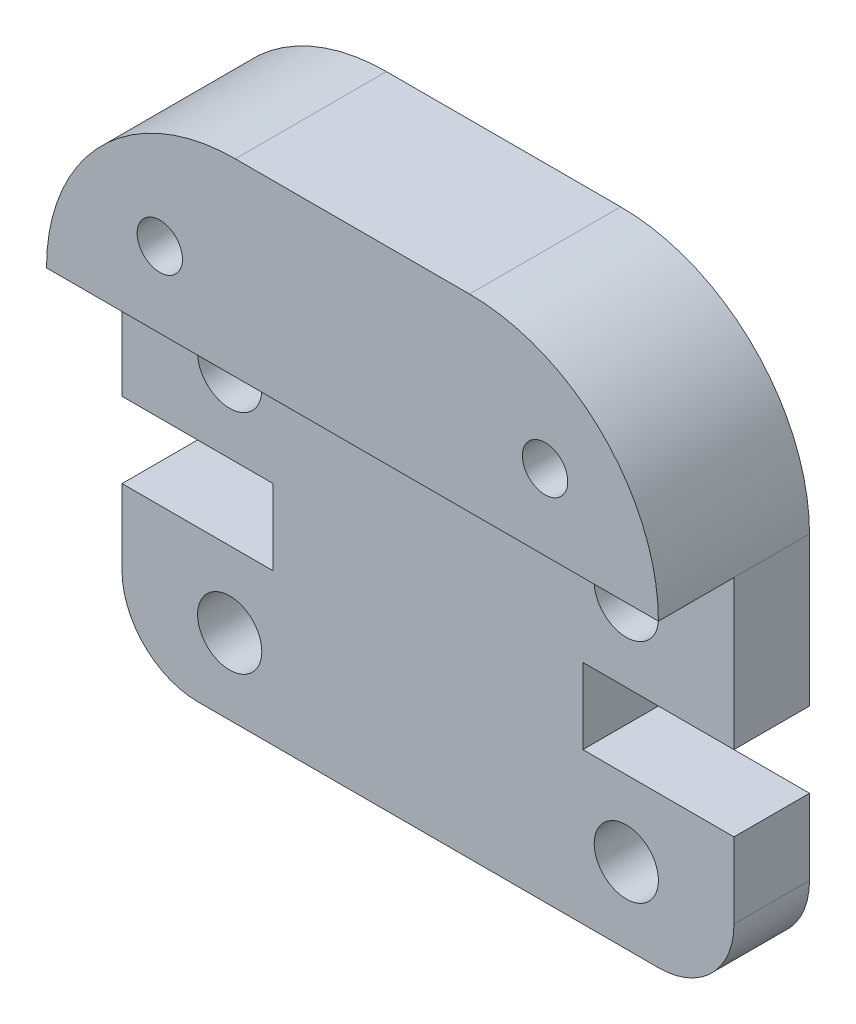
ISO-10303-21;
HEADER;
FILE_DESCRIPTION(('STEP AP214'),'2;1');
FILE_NAME('part.step','',(''),(''),'','','');
FILE_SCHEMA(('AUTOMOTIVE_DESIGN { 1 0 10303 214 1 1 1 1 }'));
ENDSEC;
DATA;
#1=APPLICATION_CONTEXT('core data for automotive mechanical design processes');
#2=APPLICATION_PROTOCOL_DEFINITION('international standard','automotive_design',2000,#1);
#3=PRODUCT_CONTEXT('',#1,'mechanical');
#4=PRODUCT('Part','Part','',(#3));
#5=PRODUCT_RELATED_PRODUCT_CATEGORY('part','',(#4));
#6=PRODUCT_DEFINITION_FORMATION('','',#4);
#7=PRODUCT_DEFINITION_CONTEXT('part definition',#1,'design');
#8=PRODUCT_DEFINITION('design','',#6,#7);
#9=PRODUCT_DEFINITION_SHAPE('','',#8);
#10=(LENGTH_UNIT() NAMED_UNIT(*) SI_UNIT(.MILLI.,.METRE.));
#11=(NAMED_UNIT(*) PLANE_ANGLE_UNIT() SI_UNIT($,.RADIAN.));
#12=(NAMED_UNIT(*) SI_UNIT($,.STERADIAN.) SOLID_ANGLE_UNIT());
#13=UNCERTAINTY_MEASURE_WITH_UNIT(LENGTH_MEASURE(1.E-05),#10,'distance_accuracy_value','');
#14=(GEOMETRIC_REPRESENTATION_CONTEXT(3) GLOBAL_UNCERTAINTY_ASSIGNED_CONTEXT((#13)) GLOBAL_UNIT_ASSIGNED_CONTEXT((#10,
#11,#12)) REPRESENTATION_CONTEXT('',''));
#15=CARTESIAN_POINT('',(0.,0.,0.));
#16=DIRECTION('',(0.,0.,1.));
#17=DIRECTION('',(1.,0.,0.));
#18=AXIS2_PLACEMENT_3D('',#15,#16,#17);
#19=CARTESIAN_POINT('',(14.2,2.,4.));
#20=DIRECTION('',(0.,0.,-1.));
#21=DIRECTION('',(-1.,0.,0.));
#22=AXIS2_PLACEMENT_3D('',#19,#20,#21);
#23=PLANE('',#22);
#24=CARTESIAN_POINT('',(3.00000000000321,11.942,4.));
#25=DIRECTION('',(0.,0.,1.));
#26=DIRECTION('',(1.,0.,0.));
#27=AXIS2_PLACEMENT_3D('',#24,#25,#26);
#28=CIRCLE('',#27,0.6);
#29=CARTESIAN_POINT('',(3.60000000000321,11.942,4.));
#30=VERTEX_POINT('',#29);
#31=EDGE_CURVE('E328',#30,#30,#28,.T.);
#32=ORIENTED_EDGE('',*,*,#31,.F.);
#33=EDGE_LOOP('',(#32));
#34=FACE_BOUND('',#33,.T.);
#35=CARTESIAN_POINT('',(13.1999999999968,11.942,4.));
#36=DIRECTION('',(0.,0.,1.));
#37=DIRECTION('',(-1.,0.,0.));
#38=AXIS2_PLACEMENT_3D('',#35,#36,#37);
#39=CIRCLE('',#38,0.6);
#40=CARTESIAN_POINT('',(12.5999999999968,11.942,4.));
#41=VERTEX_POINT('',#40);
#42=EDGE_CURVE('E334',#41,#41,#39,.T.);
#43=ORIENTED_EDGE('',*,*,#42,.F.);
#44=EDGE_LOOP('',(#43));
#45=FACE_BOUND('',#44,.T.);
#46=DIRECTION('',(1.,0.,0.));
#47=VECTOR('',#46,1.);
#48=CARTESIAN_POINT('',(16.2,9.945,4.));
#49=LINE('',#48,#47);
#50=CARTESIAN_POINT('',(0.,9.94499999999999,4.));
#51=VERTEX_POINT('',#50);
#52=CARTESIAN_POINT('',(16.2,9.945,4.));
#53=VERTEX_POINT('',#52);
#54=EDGE_CURVE('E280',#51,#53,#49,.T.);
#55=ORIENTED_EDGE('',*,*,#54,.T.);
#56=CARTESIAN_POINT('',(11.2,9.94499999999999,4.));
#57=DIRECTION('',(0.,0.,1.));
#58=DIRECTION('',(-1.,0.,0.));
#59=AXIS2_PLACEMENT_3D('',#56,#57,#58);
#60=CIRCLE('',#59,5.);
#61=CARTESIAN_POINT('',(11.2,14.945,4.));
#62=VERTEX_POINT('',#61);
#63=EDGE_CURVE('E134',#53,#62,#60,.T.);
#64=ORIENTED_EDGE('',*,*,#63,.T.);
#65=DIRECTION('',(-1.,0.,0.));
#66=VECTOR('',#65,1.);
#67=CARTESIAN_POINT('',(5.,14.945,4.));
#68=LINE('',#67,#66);
#69=CARTESIAN_POINT('',(5.,14.945,4.));
#70=VERTEX_POINT('',#69);
#71=EDGE_CURVE('E60',#62,#70,#68,.T.);
#72=ORIENTED_EDGE('',*,*,#71,.T.);
#73=CARTESIAN_POINT('',(5.,9.94499999999999,4.));
#74=DIRECTION('',(0.,0.,1.));
#75=DIRECTION('',(1.,0.,0.));
#76=AXIS2_PLACEMENT_3D('',#73,#74,#75);
#77=CIRCLE('',#76,5.);
#78=EDGE_CURVE('E125',#70,#51,#77,.T.);
#79=ORIENTED_EDGE('',*,*,#78,.T.);
#80=EDGE_LOOP('',(#55,#64,#72,#79));
#81=FACE_BOUND('',#80,.T.);
#82=ADVANCED_FACE('F35',(#34,#45,#81),#23,.F.);
#83=CARTESIAN_POINT('',(14.2,2.,4.));
#84=DIRECTION('',(0.,0.,-1.));
#85=DIRECTION('',(-1.,0.,0.));
#86=AXIS2_PLACEMENT_3D('',#83,#84,#85);
#87=CYLINDRICAL_SURFACE('',#86,2.);
#88=CARTESIAN_POINT('',(14.2,2.,2.));
#89=DIRECTION('',(0.,0.,1.));
#90=DIRECTION('',(1.,0.,0.));
#91=AXIS2_PLACEMENT_3D('',#88,#89,#90);
#92=CIRCLE('',#91,2.);
#93=CARTESIAN_POINT('',(14.2,0.,2.));
#94=VERTEX_POINT('',#93);
#95=CARTESIAN_POINT('',(16.2,2.,2.));
#96=VERTEX_POINT('',#95);
#97=EDGE_CURVE('E122',#94,#96,#92,.T.);
#98=ORIENTED_EDGE('',*,*,#97,.F.);
#99=DIRECTION('',(0.,0.,-1.));
#100=VECTOR('',#99,1.);
#101=CARTESIAN_POINT('',(14.2,0.,4.));
#102=LINE('',#101,#100);
#103=CARTESIAN_POINT('',(14.2,0.,0.));
#104=VERTEX_POINT('',#103);
#105=EDGE_CURVE('E115',#94,#104,#102,.T.);
#106=ORIENTED_EDGE('',*,*,#105,.T.);
#107=CARTESIAN_POINT('',(14.2,2.,0.));
#108=DIRECTION('',(0.,0.,1.));
#109=DIRECTION('',(-1.,0.,0.));
#110=AXIS2_PLACEMENT_3D('',#107,#108,#109);
#111=CIRCLE('',#110,2.);
#112=CARTESIAN_POINT('',(16.2,2.,0.));
#113=VERTEX_POINT('',#112);
#114=EDGE_CURVE('E119',#104,#113,#111,.T.);
#115=ORIENTED_EDGE('',*,*,#114,.T.);
#116=DIRECTION('',(0.,0.,-1.));
#117=VECTOR('',#116,1.);
#118=CARTESIAN_POINT('',(16.2,2.,4.));
#119=LINE('',#118,#117);
#120=EDGE_CURVE('E11',#96,#113,#119,.T.);
#121=ORIENTED_EDGE('',*,*,#120,.F.);
#122=EDGE_LOOP('',(#98,#106,#115,#121));
#123=FACE_BOUND('',#122,.T.);
#124=ADVANCED_FACE('F37',(#123),#87,.T.);
#125=CARTESIAN_POINT('',(16.2,2.,4.));
#126=DIRECTION('',(-1.,0.,0.));
#127=DIRECTION('',(0.,0.,1.));
#128=AXIS2_PLACEMENT_3D('',#125,#126,#127);
#129=PLANE('',#128);
#130=DIRECTION('',(0.,-1.,0.));
#131=VECTOR('',#130,1.);
#132=CARTESIAN_POINT('',(16.2,0.,2.));
#133=LINE('',#132,#131);
#134=CARTESIAN_POINT('',(16.2,4.,2.));
#135=VERTEX_POINT('',#134);
#136=EDGE_CURVE('E343',#135,#96,#133,.T.);
#137=ORIENTED_EDGE('',*,*,#136,.T.);
#138=ORIENTED_EDGE('',*,*,#120,.T.);
#139=DIRECTION('',(0.,1.,0.));
#140=VECTOR('',#139,1.);
#141=CARTESIAN_POINT('',(16.2,2.,0.));
#142=LINE('',#141,#140);
#143=CARTESIAN_POINT('',(16.2,4.,0.));
#144=VERTEX_POINT('',#143);
#145=EDGE_CURVE('E142',#113,#144,#142,.T.);
#146=ORIENTED_EDGE('',*,*,#145,.T.);
#147=DIRECTION('',(0.,0.,-1.));
#148=VECTOR('',#147,1.);
#149=CARTESIAN_POINT('',(16.2,4.,4.));
#150=LINE('',#149,#148);
#151=EDGE_CURVE('E44',#135,#144,#150,.T.);
#152=ORIENTED_EDGE('',*,*,#151,.F.);
#153=EDGE_LOOP('',(#137,#138,#146,#152));
#154=FACE_BOUND('',#153,.T.);
#155=ADVANCED_FACE('F229',(#154),#129,.F.);
#156=CARTESIAN_POINT('',(12.2,4.,4.));
#157=DIRECTION('',(0.,-1.,0.));
#158=DIRECTION('',(1.,0.,0.));
#159=AXIS2_PLACEMENT_3D('',#156,#157,#158);
#160=PLANE('',#159);
#161=DIRECTION('',(-1.,0.,0.));
#162=VECTOR('',#161,1.);
#163=CARTESIAN_POINT('',(12.2,4.,2.));
#164=LINE('',#163,#162);
#165=CARTESIAN_POINT('',(12.2,4.,2.));
#166=VERTEX_POINT('',#165);
#167=EDGE_CURVE('E226',#135,#166,#164,.T.);
#168=ORIENTED_EDGE('',*,*,#167,.F.);
#169=ORIENTED_EDGE('',*,*,#151,.T.);
#170=DIRECTION('',(-1.,0.,0.));
#171=VECTOR('',#170,1.);
#172=CARTESIAN_POINT('',(12.2,4.,0.));
#173=LINE('',#172,#171);
#174=CARTESIAN_POINT('',(12.2,4.,0.));
#175=VERTEX_POINT('',#174);
#176=EDGE_CURVE('E145',#144,#175,#173,.T.);
#177=ORIENTED_EDGE('',*,*,#176,.T.);
#178=DIRECTION('',(0.,0.,-1.));
#179=VECTOR('',#178,1.);
#180=CARTESIAN_POINT('',(12.2,4.,4.));
#181=LINE('',#180,#179);
#182=EDGE_CURVE('E216',#166,#175,#181,.T.);
#183=ORIENTED_EDGE('',*,*,#182,.F.);
#184=EDGE_LOOP('',(#168,#169,#177,#183));
#185=FACE_BOUND('',#184,.T.);
#186=ADVANCED_FACE('F221',(#185),#160,.F.);
#187=CARTESIAN_POINT('',(12.2,6.,4.));
#188=DIRECTION('',(-1.,0.,0.));
#189=DIRECTION('',(0.,0.,1.));
#190=AXIS2_PLACEMENT_3D('',#187,#188,#189);
#191=PLANE('',#190);
#192=DIRECTION('',(0.,1.,0.));
#193=VECTOR('',#192,1.);
#194=CARTESIAN_POINT('',(12.2,6.,2.));
#195=LINE('',#194,#193);
#196=CARTESIAN_POINT('',(12.2,6.,2.));
#197=VERTEX_POINT('',#196);
#198=EDGE_CURVE('E238',#166,#197,#195,.T.);
#199=ORIENTED_EDGE('',*,*,#198,.F.);
#200=ORIENTED_EDGE('',*,*,#182,.T.);
#201=DIRECTION('',(0.,1.,0.));
#202=VECTOR('',#201,1.);
#203=CARTESIAN_POINT('',(12.2,6.,0.));
#204=LINE('',#203,#202);
#205=CARTESIAN_POINT('',(12.2,6.,0.));
#206=VERTEX_POINT('',#205);
#207=EDGE_CURVE('E155',#175,#206,#204,.T.);
#208=ORIENTED_EDGE('',*,*,#207,.T.);
#209=DIRECTION('',(0.,0.,-1.));
#210=VECTOR('',#209,1.);
#211=CARTESIAN_POINT('',(12.2,6.,4.));
#212=LINE('',#211,#210);
#213=EDGE_CURVE('E214',#197,#206,#212,.T.);
#214=ORIENTED_EDGE('',*,*,#213,.F.);
#215=EDGE_LOOP('',(#199,#200,#208,#214));
#216=FACE_BOUND('',#215,.T.);
#217=ADVANCED_FACE('F235',(#216),#191,.F.);
#218=CARTESIAN_POINT('',(16.2,6.00000000000001,4.));
#219=DIRECTION('',(0.,1.,0.));
#220=DIRECTION('',(-1.,0.,0.));
#221=AXIS2_PLACEMENT_3D('',#218,#219,#220);
#222=PLANE('',#221);
#223=DIRECTION('',(1.,0.,0.));
#224=VECTOR('',#223,1.);
#225=CARTESIAN_POINT('',(16.2,6.00000000000001,2.));
#226=LINE('',#225,#224);
#227=CARTESIAN_POINT('',(16.2,6.00000000000001,2.));
#228=VERTEX_POINT('',#227);
#229=EDGE_CURVE('E310',#197,#228,#226,.T.);
#230=ORIENTED_EDGE('',*,*,#229,.F.);
#231=ORIENTED_EDGE('',*,*,#213,.T.);
#232=DIRECTION('',(1.,0.,0.));
#233=VECTOR('',#232,1.);
#234=CARTESIAN_POINT('',(16.2,6.00000000000001,0.));
#235=LINE('',#234,#233);
#236=CARTESIAN_POINT('',(16.2,6.00000000000001,0.));
#237=VERTEX_POINT('',#236);
#238=EDGE_CURVE('E158',#206,#237,#235,.T.);
#239=ORIENTED_EDGE('',*,*,#238,.T.);
#240=DIRECTION('',(0.,0.,-1.));
#241=VECTOR('',#240,1.);
#242=CARTESIAN_POINT('',(16.2,6.00000000000001,4.));
#243=LINE('',#242,#241);
#244=EDGE_CURVE('E212',#228,#237,#243,.T.);
#245=ORIENTED_EDGE('',*,*,#244,.F.);
#246=EDGE_LOOP('',(#230,#231,#239,#245));
#247=FACE_BOUND('',#246,.T.);
#248=ADVANCED_FACE('F355',(#247),#222,.F.);
#249=CARTESIAN_POINT('',(16.2,9.945,4.));
#250=DIRECTION('',(-1.,0.,0.));
#251=DIRECTION('',(0.,-1.,0.));
#252=AXIS2_PLACEMENT_3D('',#249,#250,#251);
#253=PLANE('',#252);
#254=CARTESIAN_POINT('',(16.2,9.945,2.));
#255=VERTEX_POINT('',#254);
#256=EDGE_CURVE('E289',#255,#228,#133,.T.);
#257=ORIENTED_EDGE('',*,*,#256,.T.);
#258=ORIENTED_EDGE('',*,*,#244,.T.);
#259=DIRECTION('',(0.,1.,0.));
#260=VECTOR('',#259,1.);
#261=CARTESIAN_POINT('',(16.2,9.945,0.));
#262=LINE('',#261,#260);
#263=CARTESIAN_POINT('',(16.2,9.945,0.));
#264=VERTEX_POINT('',#263);
#265=EDGE_CURVE('E161',#237,#264,#262,.T.);
#266=ORIENTED_EDGE('',*,*,#265,.T.);
#267=DIRECTION('',(0.,0.,-1.));
#268=VECTOR('',#267,1.);
#269=CARTESIAN_POINT('',(16.2,9.945,4.));
#270=LINE('',#269,#268);
#271=EDGE_CURVE('E208',#255,#264,#270,.T.);
#272=ORIENTED_EDGE('',*,*,#271,.F.);
#273=EDGE_LOOP('',(#257,#258,#266,#272));
#274=FACE_BOUND('',#273,.T.);
#275=ADVANCED_FACE('F351',(#274),#253,.F.);
#276=CARTESIAN_POINT('',(0.,9.94499999999999,4.));
#277=DIRECTION('',(1.,0.,0.));
#278=DIRECTION('',(0.,0.,-1.));
#279=AXIS2_PLACEMENT_3D('',#276,#277,#278);
#280=PLANE('',#279);
#281=DIRECTION('',(0.,1.,0.));
#282=VECTOR('',#281,1.);
#283=CARTESIAN_POINT('',(0.,9.94499999999999,2.));
#284=LINE('',#283,#282);
#285=CARTESIAN_POINT('',(0.,6.00000000000001,2.));
#286=VERTEX_POINT('',#285);
#287=CARTESIAN_POINT('',(0.,9.94499999999999,2.));
#288=VERTEX_POINT('',#287);
#289=EDGE_CURVE('E286',#286,#288,#284,.T.);
#290=ORIENTED_EDGE('',*,*,#289,.T.);
#291=DIRECTION('',(0.,0.,-1.));
#292=VECTOR('',#291,1.);
#293=CARTESIAN_POINT('',(0.,9.94499999999999,4.));
#294=LINE('',#293,#292);
#295=CARTESIAN_POINT('',(0.,9.94499999999999,0.));
#296=VERTEX_POINT('',#295);
#297=EDGE_CURVE('E198',#288,#296,#294,.T.);
#298=ORIENTED_EDGE('',*,*,#297,.T.);
#299=DIRECTION('',(0.,-1.,0.));
#300=VECTOR('',#299,1.);
#301=CARTESIAN_POINT('',(0.,9.94499999999999,0.));
#302=LINE('',#301,#300);
#303=CARTESIAN_POINT('',(0.,6.00000000000001,0.));
#304=VERTEX_POINT('',#303);
#305=EDGE_CURVE('E171',#296,#304,#302,.T.);
#306=ORIENTED_EDGE('',*,*,#305,.T.);
#307=DIRECTION('',(0.,0.,-1.));
#308=VECTOR('',#307,1.);
#309=CARTESIAN_POINT('',(0.,6.00000000000001,4.));
#310=LINE('',#309,#308);
#311=EDGE_CURVE('E196',#286,#304,#310,.T.);
#312=ORIENTED_EDGE('',*,*,#311,.F.);
#313=EDGE_LOOP('',(#290,#298,#306,#312));
#314=FACE_BOUND('',#313,.T.);
#315=ADVANCED_FACE('F295',(#314),#280,.F.);
#316=CARTESIAN_POINT('',(0.,6.00000000000001,4.));
#317=DIRECTION('',(0.,1.,0.));
#318=DIRECTION('',(0.,0.,1.));
#319=AXIS2_PLACEMENT_3D('',#316,#317,#318);
#320=PLANE('',#319);
#321=DIRECTION('',(1.,0.,0.));
#322=VECTOR('',#321,1.);
#323=CARTESIAN_POINT('',(0.,6.00000000000001,2.));
#324=LINE('',#323,#322);
#325=CARTESIAN_POINT('',(4.,6.00000000000001,2.));
#326=VERTEX_POINT('',#325);
#327=EDGE_CURVE('E308',#286,#326,#324,.T.);
#328=ORIENTED_EDGE('',*,*,#327,.F.);
#329=ORIENTED_EDGE('',*,*,#311,.T.);
#330=DIRECTION('',(1.,0.,0.));
#331=VECTOR('',#330,1.);
#332=CARTESIAN_POINT('',(0.,6.00000000000001,0.));
#333=LINE('',#332,#331);
#334=CARTESIAN_POINT('',(4.,6.00000000000001,0.));
#335=VERTEX_POINT('',#334);
#336=EDGE_CURVE('E174',#304,#335,#333,.T.);
#337=ORIENTED_EDGE('',*,*,#336,.T.);
#338=DIRECTION('',(0.,0.,-1.));
#339=VECTOR('',#338,1.);
#340=CARTESIAN_POINT('',(4.,6.00000000000001,4.));
#341=LINE('',#340,#339);
#342=EDGE_CURVE('E194',#326,#335,#341,.T.);
#343=ORIENTED_EDGE('',*,*,#342,.F.);
#344=EDGE_LOOP('',(#328,#329,#337,#343));
#345=FACE_BOUND('',#344,.T.);
#346=ADVANCED_FACE('F307',(#345),#320,.F.);
#347=CARTESIAN_POINT('',(4.,6.00000000000001,4.));
#348=DIRECTION('',(1.,0.,0.));
#349=DIRECTION('',(0.,0.,-1.));
#350=AXIS2_PLACEMENT_3D('',#347,#348,#349);
#351=PLANE('',#350);
#352=DIRECTION('',(0.,-1.,0.));
#353=VECTOR('',#352,1.);
#354=CARTESIAN_POINT('',(4.,6.00000000000001,2.));
#355=LINE('',#354,#353);
#356=CARTESIAN_POINT('',(4.,4.,2.));
#357=VERTEX_POINT('',#356);
#358=EDGE_CURVE('E311',#326,#357,#355,.T.);
#359=ORIENTED_EDGE('',*,*,#358,.F.);
#360=ORIENTED_EDGE('',*,*,#342,.T.);
#361=DIRECTION('',(0.,-1.,0.));
#362=VECTOR('',#361,1.);
#363=CARTESIAN_POINT('',(4.,6.00000000000001,0.));
#364=LINE('',#363,#362);
#365=CARTESIAN_POINT('',(4.,4.,0.));
#366=VERTEX_POINT('',#365);
#367=EDGE_CURVE('E177',#335,#366,#364,.T.);
#368=ORIENTED_EDGE('',*,*,#367,.T.);
#369=DIRECTION('',(0.,0.,-1.));
#370=VECTOR('',#369,1.);
#371=CARTESIAN_POINT('',(4.,4.,4.));
#372=LINE('',#371,#370);
#373=EDGE_CURVE('E192',#357,#366,#372,.T.);
#374=ORIENTED_EDGE('',*,*,#373,.F.);
#375=EDGE_LOOP('',(#359,#360,#368,#374));
#376=FACE_BOUND('',#375,.T.);
#377=ADVANCED_FACE('F393',(#376),#351,.F.);
#378=CARTESIAN_POINT('',(4.,4.,4.));
#379=DIRECTION('',(0.,-1.,0.));
#380=DIRECTION('',(0.,0.,-1.));
#381=AXIS2_PLACEMENT_3D('',#378,#379,#380);
#382=PLANE('',#381);
#383=DIRECTION('',(-1.,0.,0.));
#384=VECTOR('',#383,1.);
#385=CARTESIAN_POINT('',(4.,4.,2.));
#386=LINE('',#385,#384);
#387=CARTESIAN_POINT('',(0.,4.,2.));
#388=VERTEX_POINT('',#387);
#389=EDGE_CURVE('E314',#357,#388,#386,.T.);
#390=ORIENTED_EDGE('',*,*,#389,.F.);
#391=ORIENTED_EDGE('',*,*,#373,.T.);
#392=DIRECTION('',(-1.,0.,0.));
#393=VECTOR('',#392,1.);
#394=CARTESIAN_POINT('',(4.,4.,0.));
#395=LINE('',#394,#393);
#396=CARTESIAN_POINT('',(0.,4.,0.));
#397=VERTEX_POINT('',#396);
#398=EDGE_CURVE('E180',#366,#397,#395,.T.);
#399=ORIENTED_EDGE('',*,*,#398,.T.);
#400=DIRECTION('',(0.,0.,-1.));
#401=VECTOR('',#400,1.);
#402=CARTESIAN_POINT('',(0.,4.,4.));
#403=LINE('',#402,#401);
#404=EDGE_CURVE('E190',#388,#397,#403,.T.);
#405=ORIENTED_EDGE('',*,*,#404,.F.);
#406=EDGE_LOOP('',(#390,#391,#399,#405));
#407=FACE_BOUND('',#406,.T.);
#408=ADVANCED_FACE('F389',(#407),#382,.F.);
#409=CARTESIAN_POINT('',(0.,2.,4.));
#410=DIRECTION('',(1.,0.,0.));
#411=DIRECTION('',(0.,0.,-1.));
#412=AXIS2_PLACEMENT_3D('',#409,#410,#411);
#413=PLANE('',#412);
#414=CARTESIAN_POINT('',(0.,2.,2.));
#415=VERTEX_POINT('',#414);
#416=EDGE_CURVE('E291',#415,#388,#284,.T.);
#417=ORIENTED_EDGE('',*,*,#416,.T.);
#418=ORIENTED_EDGE('',*,*,#404,.T.);
#419=DIRECTION('',(0.,-1.,0.));
#420=VECTOR('',#419,1.);
#421=CARTESIAN_POINT('',(0.,2.,0.));
#422=LINE('',#421,#420);
#423=CARTESIAN_POINT('',(0.,2.,0.));
#424=VERTEX_POINT('',#423);
#425=EDGE_CURVE('E183',#397,#424,#422,.T.);
#426=ORIENTED_EDGE('',*,*,#425,.T.);
#427=DIRECTION('',(0.,0.,-1.));
#428=VECTOR('',#427,1.);
#429=CARTESIAN_POINT('',(0.,2.,4.));
#430=LINE('',#429,#428);
#431=EDGE_CURVE('E188',#415,#424,#430,.T.);
#432=ORIENTED_EDGE('',*,*,#431,.F.);
#433=EDGE_LOOP('',(#417,#418,#426,#432));
#434=FACE_BOUND('',#433,.T.);
#435=ADVANCED_FACE('F385',(#434),#413,.F.);
#436=CARTESIAN_POINT('',(2.,2.,4.));
#437=DIRECTION('',(0.,0.,-1.));
#438=DIRECTION('',(-1.,0.,0.));
#439=AXIS2_PLACEMENT_3D('',#436,#437,#438);
#440=CYLINDRICAL_SURFACE('',#439,2.);
#441=CARTESIAN_POINT('',(2.,2.,2.));
#442=DIRECTION('',(0.,0.,1.));
#443=DIRECTION('',(1.,0.,0.));
#444=AXIS2_PLACEMENT_3D('',#441,#442,#443);
#445=CIRCLE('',#444,2.);
#446=CARTESIAN_POINT('',(2.,0.,2.));
#447=VERTEX_POINT('',#446);
#448=EDGE_CURVE('E51',#415,#447,#445,.T.);
#449=ORIENTED_EDGE('',*,*,#448,.F.);
#450=ORIENTED_EDGE('',*,*,#431,.T.);
#451=CARTESIAN_POINT('',(2.,2.,0.));
#452=DIRECTION('',(0.,0.,1.));
#453=DIRECTION('',(1.,0.,0.));
#454=AXIS2_PLACEMENT_3D('',#451,#452,#453);
#455=CIRCLE('',#454,2.);
#456=CARTESIAN_POINT('',(2.,0.,0.));
#457=VERTEX_POINT('',#456);
#458=EDGE_CURVE('E135',#424,#457,#455,.T.);
#459=ORIENTED_EDGE('',*,*,#458,.T.);
#460=DIRECTION('',(0.,0.,-1.));
#461=VECTOR('',#460,1.);
#462=CARTESIAN_POINT('',(2.,0.,4.));
#463=LINE('',#462,#461);
#464=EDGE_CURVE('E124',#447,#457,#463,.T.);
#465=ORIENTED_EDGE('',*,*,#464,.F.);
#466=EDGE_LOOP('',(#449,#450,#459,#465));
#467=FACE_BOUND('',#466,.T.);
#468=ADVANCED_FACE('F382',(#467),#440,.T.);
#469=CARTESIAN_POINT('',(2.,0.,4.));
#470=DIRECTION('',(0.,1.,0.));
#471=DIRECTION('',(-1.,0.,0.));
#472=AXIS2_PLACEMENT_3D('',#469,#470,#471);
#473=PLANE('',#472);
#474=DIRECTION('',(-1.,0.,0.));
#475=VECTOR('',#474,1.);
#476=CARTESIAN_POINT('',(0.,0.,2.));
#477=LINE('',#476,#475);
#478=EDGE_CURVE('E296',#94,#447,#477,.T.);
#479=ORIENTED_EDGE('',*,*,#478,.T.);
#480=ORIENTED_EDGE('',*,*,#464,.T.);
#481=DIRECTION('',(1.,0.,0.));
#482=VECTOR('',#481,1.);
#483=CARTESIAN_POINT('',(2.,0.,0.));
#484=LINE('',#483,#482);
#485=EDGE_CURVE('E128',#457,#104,#484,.T.);
#486=ORIENTED_EDGE('',*,*,#485,.T.);
#487=ORIENTED_EDGE('',*,*,#105,.F.);
#488=EDGE_LOOP('',(#479,#480,#486,#487));
#489=FACE_BOUND('',#488,.T.);
#490=ADVANCED_FACE('F129',(#489),#473,.F.);
#491=CARTESIAN_POINT('',(13.35,8.,4.));
#492=DIRECTION('',(0.,0.,-1.));
#493=DIRECTION('',(-1.,0.,0.));
#494=AXIS2_PLACEMENT_3D('',#491,#492,#493);
#495=CYLINDRICAL_SURFACE('',#494,0.85);
#496=CARTESIAN_POINT('',(13.35,8.,0.));
#497=DIRECTION('',(0.,0.,1.));
#498=DIRECTION('',(1.,0.,0.));
#499=AXIS2_PLACEMENT_3D('',#496,#497,#498);
#500=CIRCLE('',#499,0.85);
#501=CARTESIAN_POINT('',(14.2,8.,0.));
#502=VERTEX_POINT('',#501);
#503=EDGE_CURVE('E143',#502,#502,#500,.T.);
#504=ORIENTED_EDGE('',*,*,#503,.F.);
#505=EDGE_LOOP('',(#504));
#506=FACE_BOUND('',#505,.T.);
#507=CARTESIAN_POINT('',(13.35,8.,2.));
#508=DIRECTION('',(0.,0.,1.));
#509=DIRECTION('',(1.,0.,0.));
#510=AXIS2_PLACEMENT_3D('',#507,#508,#509);
#511=CIRCLE('',#510,0.85);
#512=CARTESIAN_POINT('',(14.2,8.,2.));
#513=VERTEX_POINT('',#512);
#514=EDGE_CURVE('E595',#513,#513,#511,.T.);
#515=ORIENTED_EDGE('',*,*,#514,.T.);
#516=EDGE_LOOP('',(#515));
#517=FACE_BOUND('',#516,.T.);
#518=ADVANCED_FACE('F374',(#506,#517),#495,.F.);
#519=CARTESIAN_POINT('',(13.35,2.,4.));
#520=DIRECTION('',(0.,0.,-1.));
#521=DIRECTION('',(-1.,0.,0.));
#522=AXIS2_PLACEMENT_3D('',#519,#520,#521);
#523=CYLINDRICAL_SURFACE('',#522,0.85);
#524=CARTESIAN_POINT('',(13.35,2.,0.));
#525=DIRECTION('',(0.,0.,1.));
#526=DIRECTION('',(-1.,0.,0.));
#527=AXIS2_PLACEMENT_3D('',#524,#525,#526);
#528=CIRCLE('',#527,0.85);
#529=CARTESIAN_POINT('',(12.5,2.,0.));
#530=VERTEX_POINT('',#529);
#531=EDGE_CURVE('E148',#530,#530,#528,.T.);
#532=ORIENTED_EDGE('',*,*,#531,.F.);
#533=EDGE_LOOP('',(#532));
#534=FACE_BOUND('',#533,.T.);
#535=CARTESIAN_POINT('',(13.35,2.,2.));
#536=DIRECTION('',(0.,0.,1.));
#537=DIRECTION('',(1.,0.,0.));
#538=AXIS2_PLACEMENT_3D('',#535,#536,#537);
#539=CIRCLE('',#538,0.85);
#540=CARTESIAN_POINT('',(14.2,2.,2.));
#541=VERTEX_POINT('',#540);
#542=EDGE_CURVE('E590',#541,#541,#539,.T.);
#543=ORIENTED_EDGE('',*,*,#542,.T.);
#544=EDGE_LOOP('',(#543));
#545=FACE_BOUND('',#544,.T.);
#546=ADVANCED_FACE('F533',(#534,#545),#523,.F.);
#547=CARTESIAN_POINT('',(2.85,2.,4.));
#548=DIRECTION('',(0.,0.,-1.));
#549=DIRECTION('',(-1.,0.,0.));
#550=AXIS2_PLACEMENT_3D('',#547,#548,#549);
#551=CYLINDRICAL_SURFACE('',#550,0.85);
#552=CARTESIAN_POINT('',(2.85,2.,0.));
#553=DIRECTION('',(0.,0.,1.));
#554=DIRECTION('',(1.,0.,0.));
#555=AXIS2_PLACEMENT_3D('',#552,#553,#554);
#556=CIRCLE('',#555,0.85);
#557=CARTESIAN_POINT('',(3.7,2.,0.));
#558=VERTEX_POINT('',#557);
#559=EDGE_CURVE('E324',#558,#558,#556,.T.);
#560=ORIENTED_EDGE('',*,*,#559,.F.);
#561=EDGE_LOOP('',(#560));
#562=FACE_BOUND('',#561,.T.);
#563=CARTESIAN_POINT('',(2.85,2.,2.));
#564=DIRECTION('',(0.,0.,1.));
#565=DIRECTION('',(1.,0.,0.));
#566=AXIS2_PLACEMENT_3D('',#563,#564,#565);
#567=CIRCLE('',#566,0.85);
#568=CARTESIAN_POINT('',(3.7,2.,2.));
#569=VERTEX_POINT('',#568);
#570=EDGE_CURVE('E588',#569,#569,#567,.T.);
#571=ORIENTED_EDGE('',*,*,#570,.T.);
#572=EDGE_LOOP('',(#571));
#573=FACE_BOUND('',#572,.T.);
#574=ADVANCED_FACE('F541',(#562,#573),#551,.F.);
#575=CARTESIAN_POINT('',(2.85,8.,4.));
#576=DIRECTION('',(0.,0.,-1.));
#577=DIRECTION('',(-1.,0.,0.));
#578=AXIS2_PLACEMENT_3D('',#575,#576,#577);
#579=CYLINDRICAL_SURFACE('',#578,0.85);
#580=CARTESIAN_POINT('',(2.85,8.,0.));
#581=DIRECTION('',(0.,0.,1.));
#582=DIRECTION('',(-1.,0.,0.));
#583=AXIS2_PLACEMENT_3D('',#580,#581,#582);
#584=CIRCLE('',#583,0.85);
#585=CARTESIAN_POINT('',(2.,8.,0.));
#586=VERTEX_POINT('',#585);
#587=EDGE_CURVE('E321',#586,#586,#584,.T.);
#588=ORIENTED_EDGE('',*,*,#587,.F.);
#589=EDGE_LOOP('',(#588));
#590=FACE_BOUND('',#589,.T.);
#591=CARTESIAN_POINT('',(2.85,8.,2.));
#592=DIRECTION('',(0.,0.,1.));
#593=DIRECTION('',(1.,0.,0.));
#594=AXIS2_PLACEMENT_3D('',#591,#592,#593);
#595=CIRCLE('',#594,0.85);
#596=CARTESIAN_POINT('',(3.7,8.,2.));
#597=VERTEX_POINT('',#596);
#598=EDGE_CURVE('E39',#597,#597,#595,.T.);
#599=ORIENTED_EDGE('',*,*,#598,.T.);
#600=EDGE_LOOP('',(#599));
#601=FACE_BOUND('',#600,.T.);
#602=ADVANCED_FACE('F378',(#590,#601),#579,.F.);
#603=CARTESIAN_POINT('',(14.2,2.,0.));
#604=DIRECTION('',(0.,0.,-1.));
#605=DIRECTION('',(-1.,0.,0.));
#606=AXIS2_PLACEMENT_3D('',#603,#604,#605);
#607=PLANE('',#606);
#608=ORIENTED_EDGE('',*,*,#559,.T.);
#609=EDGE_LOOP('',(#608));
#610=FACE_BOUND('',#609,.T.);
#611=CARTESIAN_POINT('',(13.1999999999968,11.942,0.));
#612=DIRECTION('',(0.,0.,1.));
#613=DIRECTION('',(-1.,0.,0.));
#614=AXIS2_PLACEMENT_3D('',#611,#612,#613);
#615=CIRCLE('',#614,0.6);
#616=CARTESIAN_POINT('',(12.5999999999968,11.942,0.));
#617=VERTEX_POINT('',#616);
#618=EDGE_CURVE('E331',#617,#617,#615,.T.);
#619=ORIENTED_EDGE('',*,*,#618,.T.);
#620=EDGE_LOOP('',(#619));
#621=FACE_BOUND('',#620,.T.);
#622=ORIENTED_EDGE('',*,*,#503,.T.);
#623=EDGE_LOOP('',(#622));
#624=FACE_BOUND('',#623,.T.);
#625=ORIENTED_EDGE('',*,*,#114,.F.);
#626=ORIENTED_EDGE('',*,*,#485,.F.);
#627=ORIENTED_EDGE('',*,*,#458,.F.);
#628=ORIENTED_EDGE('',*,*,#425,.F.);
#629=ORIENTED_EDGE('',*,*,#398,.F.);
#630=ORIENTED_EDGE('',*,*,#367,.F.);
#631=ORIENTED_EDGE('',*,*,#336,.F.);
#632=ORIENTED_EDGE('',*,*,#305,.F.);
#633=CARTESIAN_POINT('',(5.,9.94499999999999,0.));
#634=DIRECTION('',(0.,0.,1.));
#635=DIRECTION('',(1.,0.,0.));
#636=AXIS2_PLACEMENT_3D('',#633,#634,#635);
#637=CIRCLE('',#636,5.);
#638=CARTESIAN_POINT('',(5.,14.945,0.));
#639=VERTEX_POINT('',#638);
#640=EDGE_CURVE('E168',#639,#296,#637,.T.);
#641=ORIENTED_EDGE('',*,*,#640,.F.);
#642=DIRECTION('',(-1.,0.,0.));
#643=VECTOR('',#642,1.);
#644=CARTESIAN_POINT('',(5.,14.945,0.));
#645=LINE('',#644,#643);
#646=CARTESIAN_POINT('',(11.2,14.945,0.));
#647=VERTEX_POINT('',#646);
#648=EDGE_CURVE('E166',#647,#639,#645,.T.);
#649=ORIENTED_EDGE('',*,*,#648,.F.);
#650=CARTESIAN_POINT('',(11.2,9.94499999999999,0.));
#651=DIRECTION('',(0.,0.,1.));
#652=DIRECTION('',(-1.,0.,0.));
#653=AXIS2_PLACEMENT_3D('',#650,#651,#652);
#654=CIRCLE('',#653,5.);
#655=EDGE_CURVE('E164',#264,#647,#654,.T.);
#656=ORIENTED_EDGE('',*,*,#655,.F.);
#657=ORIENTED_EDGE('',*,*,#265,.F.);
#658=ORIENTED_EDGE('',*,*,#238,.F.);
#659=ORIENTED_EDGE('',*,*,#207,.F.);
#660=ORIENTED_EDGE('',*,*,#176,.F.);
#661=ORIENTED_EDGE('',*,*,#145,.F.);
#662=EDGE_LOOP('',(#625,#626,#627,#628,#629,#630,#631,#632,#641,#649,#656,#657,#658,#659,#660,#661));
#663=FACE_BOUND('',#662,.T.);
#664=ORIENTED_EDGE('',*,*,#531,.T.);
#665=EDGE_LOOP('',(#664));
#666=FACE_BOUND('',#665,.T.);
#667=CARTESIAN_POINT('',(3.00000000000321,11.942,0.));
#668=DIRECTION('',(0.,0.,1.));
#669=DIRECTION('',(1.,0.,0.));
#670=AXIS2_PLACEMENT_3D('',#667,#668,#669);
#671=CIRCLE('',#670,0.6);
#672=CARTESIAN_POINT('',(3.60000000000321,11.942,0.));
#673=VERTEX_POINT('',#672);
#674=EDGE_CURVE('E327',#673,#673,#671,.T.);
#675=ORIENTED_EDGE('',*,*,#674,.T.);
#676=EDGE_LOOP('',(#675));
#677=FACE_BOUND('',#676,.T.);
#678=ORIENTED_EDGE('',*,*,#587,.T.);
#679=EDGE_LOOP('',(#678));
#680=FACE_BOUND('',#679,.T.);
#681=ADVANCED_FACE('F138',(#610,#621,#624,#663,#666,#677,#680),#607,.T.);
#682=CARTESIAN_POINT('',(11.2,9.94499999999999,4.));
#683=DIRECTION('',(0.,0.,-1.));
#684=DIRECTION('',(-1.,0.,0.));
#685=AXIS2_PLACEMENT_3D('',#682,#683,#684);
#686=CYLINDRICAL_SURFACE('',#685,5.);
#687=ORIENTED_EDGE('',*,*,#655,.T.);
#688=DIRECTION('',(0.,0.,-1.));
#689=VECTOR('',#688,1.);
#690=CARTESIAN_POINT('',(11.2,14.945,4.));
#691=LINE('',#690,#689);
#692=EDGE_CURVE('E205',#62,#647,#691,.T.);
#693=ORIENTED_EDGE('',*,*,#692,.F.);
#694=ORIENTED_EDGE('',*,*,#63,.F.);
#695=EDGE_CURVE('E209',#53,#255,#270,.T.);
#696=ORIENTED_EDGE('',*,*,#695,.T.);
#697=ORIENTED_EDGE('',*,*,#271,.T.);
#698=EDGE_LOOP('',(#687,#693,#694,#696,#697));
#699=FACE_BOUND('',#698,.T.);
#700=ADVANCED_FACE('F346',(#699),#686,.T.);
#701=CARTESIAN_POINT('',(5.,14.945,4.));
#702=DIRECTION('',(0.,-1.,0.));
#703=DIRECTION('',(0.,0.,-1.));
#704=AXIS2_PLACEMENT_3D('',#701,#702,#703);
#705=PLANE('',#704);
#706=ORIENTED_EDGE('',*,*,#648,.T.);
#707=DIRECTION('',(0.,0.,-1.));
#708=VECTOR('',#707,1.);
#709=CARTESIAN_POINT('',(5.,14.945,4.));
#710=LINE('',#709,#708);
#711=EDGE_CURVE('E202',#70,#639,#710,.T.);
#712=ORIENTED_EDGE('',*,*,#711,.F.);
#713=ORIENTED_EDGE('',*,*,#71,.F.);
#714=ORIENTED_EDGE('',*,*,#692,.T.);
#715=EDGE_LOOP('',(#706,#712,#713,#714));
#716=FACE_BOUND('',#715,.T.);
#717=ADVANCED_FACE('F349',(#716),#705,.F.);
#718=CARTESIAN_POINT('',(5.,9.94499999999999,4.));
#719=DIRECTION('',(0.,0.,-1.));
#720=DIRECTION('',(-1.,0.,0.));
#721=AXIS2_PLACEMENT_3D('',#718,#719,#720);
#722=CYLINDRICAL_SURFACE('',#721,5.);
#723=ORIENTED_EDGE('',*,*,#640,.T.);
#724=ORIENTED_EDGE('',*,*,#297,.F.);
#725=EDGE_CURVE('E199',#51,#288,#294,.T.);
#726=ORIENTED_EDGE('',*,*,#725,.F.);
#727=ORIENTED_EDGE('',*,*,#78,.F.);
#728=ORIENTED_EDGE('',*,*,#711,.T.);
#729=EDGE_LOOP('',(#723,#724,#726,#727,#728));
#730=FACE_BOUND('',#729,.T.);
#731=ADVANCED_FACE('F298',(#730),#722,.T.);
#732=CARTESIAN_POINT('',(13.1999999999968,11.942,4.));
#733=DIRECTION('',(0.,0.,-1.));
#734=DIRECTION('',(-1.,0.,0.));
#735=AXIS2_PLACEMENT_3D('',#732,#733,#734);
#736=CYLINDRICAL_SURFACE('',#735,0.6);
#737=ORIENTED_EDGE('',*,*,#42,.T.);
#738=EDGE_LOOP('',(#737));
#739=FACE_BOUND('',#738,.T.);
#740=ORIENTED_EDGE('',*,*,#618,.F.);
#741=EDGE_LOOP('',(#740));
#742=FACE_BOUND('',#741,.T.);
#743=ADVANCED_FACE('F404',(#739,#742),#736,.F.);
#744=CARTESIAN_POINT('',(3.00000000000321,11.942,4.));
#745=DIRECTION('',(0.,0.,-1.));
#746=DIRECTION('',(-1.,0.,0.));
#747=AXIS2_PLACEMENT_3D('',#744,#745,#746);
#748=CYLINDRICAL_SURFACE('',#747,0.6);
#749=ORIENTED_EDGE('',*,*,#31,.T.);
#750=EDGE_LOOP('',(#749));
#751=FACE_BOUND('',#750,.T.);
#752=ORIENTED_EDGE('',*,*,#674,.F.);
#753=EDGE_LOOP('',(#752));
#754=FACE_BOUND('',#753,.T.);
#755=ADVANCED_FACE('F429',(#751,#754),#748,.F.);
#756=CARTESIAN_POINT('',(0.,0.,2.));
#757=DIRECTION('',(0.,0.,1.));
#758=DIRECTION('',(1.,0.,0.));
#759=AXIS2_PLACEMENT_3D('',#756,#757,#758);
#760=PLANE('',#759);
#761=ORIENTED_EDGE('',*,*,#514,.F.);
#762=EDGE_LOOP('',(#761));
#763=FACE_BOUND('',#762,.T.);
#764=ORIENTED_EDGE('',*,*,#542,.F.);
#765=EDGE_LOOP('',(#764));
#766=FACE_BOUND('',#765,.T.);
#767=ORIENTED_EDGE('',*,*,#570,.F.);
#768=EDGE_LOOP('',(#767));
#769=FACE_BOUND('',#768,.T.);
#770=ORIENTED_EDGE('',*,*,#598,.F.);
#771=EDGE_LOOP('',(#770));
#772=FACE_BOUND('',#771,.T.);
#773=ORIENTED_EDGE('',*,*,#97,.T.);
#774=ORIENTED_EDGE('',*,*,#136,.F.);
#775=ORIENTED_EDGE('',*,*,#167,.T.);
#776=ORIENTED_EDGE('',*,*,#198,.T.);
#777=ORIENTED_EDGE('',*,*,#229,.T.);
#778=ORIENTED_EDGE('',*,*,#256,.F.);
#779=DIRECTION('',(1.,0.,0.));
#780=VECTOR('',#779,1.);
#781=CARTESIAN_POINT('',(16.2,9.945,2.));
#782=LINE('',#781,#780);
#783=EDGE_CURVE('E277',#288,#255,#782,.T.);
#784=ORIENTED_EDGE('',*,*,#783,.F.);
#785=ORIENTED_EDGE('',*,*,#289,.F.);
#786=ORIENTED_EDGE('',*,*,#327,.T.);
#787=ORIENTED_EDGE('',*,*,#358,.T.);
#788=ORIENTED_EDGE('',*,*,#389,.T.);
#789=ORIENTED_EDGE('',*,*,#416,.F.);
#790=ORIENTED_EDGE('',*,*,#448,.T.);
#791=ORIENTED_EDGE('',*,*,#478,.F.);
#792=EDGE_LOOP('',(#773,#774,#775,#776,#777,#778,#784,#785,#786,#787,#788,#789,#790,#791));
#793=FACE_BOUND('',#792,.T.);
#794=ADVANCED_FACE('F285',(#763,#766,#769,#772,#793),#760,.T.);
#795=CARTESIAN_POINT('',(16.2,9.945,2.));
#796=DIRECTION('',(0.,-1.,0.));
#797=DIRECTION('',(1.,0.,0.));
#798=AXIS2_PLACEMENT_3D('',#795,#796,#797);
#799=PLANE('',#798);
#800=ORIENTED_EDGE('',*,*,#54,.F.);
#801=ORIENTED_EDGE('',*,*,#725,.T.);
#802=ORIENTED_EDGE('',*,*,#783,.T.);
#803=ORIENTED_EDGE('',*,*,#695,.F.);
#804=EDGE_LOOP('',(#800,#801,#802,#803));
#805=FACE_BOUND('',#804,.T.);
#806=ADVANCED_FACE('F276',(#805),#799,.T.);
#807=CLOSED_SHELL('',(#82,#124,#155,#186,#217,#248,#275,#315,#346,#377,#408,#435,#468,#490,#518,
#546,#574,#602,#681,#700,#717,#731,#743,#755,#794,#806));
#808=MANIFOLD_SOLID_BREP('B2',#807);
#809=ADVANCED_BREP_SHAPE_REPRESENTATION('',(#18,#808),#14);
#810=SHAPE_DEFINITION_REPRESENTATION(#9,#809);
ENDSEC;
END-ISO-10303-21;
